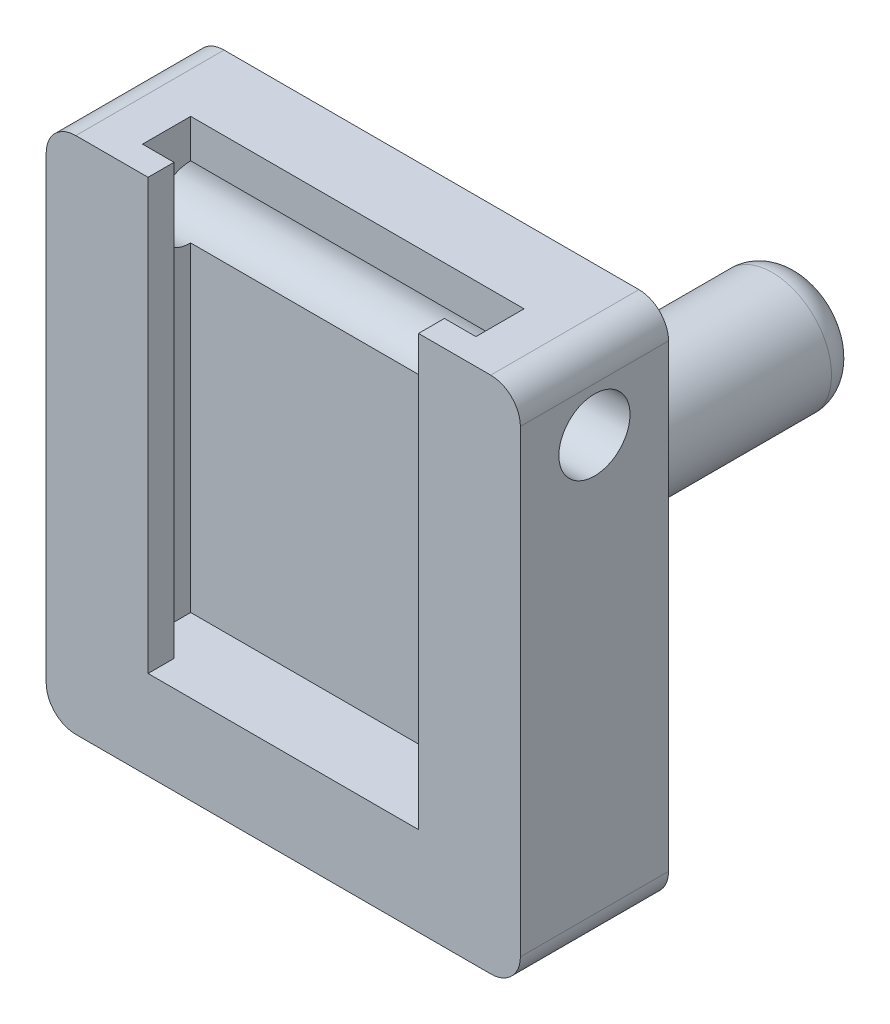
ISO-10303-21;
HEADER;
FILE_DESCRIPTION(('STEP AP214'),'2;1');
FILE_NAME('part.step','',(''),(''),'','','');
FILE_SCHEMA(('AUTOMOTIVE_DESIGN { 1 0 10303 214 1 1 1 1 }'));
ENDSEC;
DATA;
#1=APPLICATION_CONTEXT('core data for automotive mechanical design processes');
#2=APPLICATION_PROTOCOL_DEFINITION('international standard','automotive_design',2000,#1);
#3=PRODUCT_CONTEXT('',#1,'mechanical');
#4=PRODUCT('Part','Part','',(#3));
#5=PRODUCT_RELATED_PRODUCT_CATEGORY('part','',(#4));
#6=PRODUCT_DEFINITION_FORMATION('','',#4);
#7=PRODUCT_DEFINITION_CONTEXT('part definition',#1,'design');
#8=PRODUCT_DEFINITION('design','',#6,#7);
#9=PRODUCT_DEFINITION_SHAPE('','',#8);
#10=(LENGTH_UNIT() NAMED_UNIT(*) SI_UNIT(.MILLI.,.METRE.));
#11=(NAMED_UNIT(*) PLANE_ANGLE_UNIT() SI_UNIT($,.RADIAN.));
#12=(NAMED_UNIT(*) SI_UNIT($,.STERADIAN.) SOLID_ANGLE_UNIT());
#13=UNCERTAINTY_MEASURE_WITH_UNIT(LENGTH_MEASURE(1.E-05),#10,'distance_accuracy_value','');
#14=(GEOMETRIC_REPRESENTATION_CONTEXT(3) GLOBAL_UNCERTAINTY_ASSIGNED_CONTEXT((#13)) GLOBAL_UNIT_ASSIGNED_CONTEXT((#10,
#11,#12)) REPRESENTATION_CONTEXT('',''));
#15=CARTESIAN_POINT('',(0.,0.,0.));
#16=DIRECTION('',(0.,0.,1.));
#17=DIRECTION('',(1.,0.,0.));
#18=AXIS2_PLACEMENT_3D('',#15,#16,#17);
#19=CARTESIAN_POINT('',(-11.25,-36.5488611432323,5.));
#20=DIRECTION('',(0.,0.,-1.));
#21=DIRECTION('',(-1.,0.,0.));
#22=AXIS2_PLACEMENT_3D('',#19,#20,#21);
#23=PLANE('',#22);
#24=DIRECTION('',(0.,1.,0.));
#25=VECTOR('',#24,1.);
#26=CARTESIAN_POINT('',(11.25,-36.5488611432323,5.));
#27=LINE('',#26,#25);
#28=CARTESIAN_POINT('',(11.25,-7.50000000000007,5.));
#29=VERTEX_POINT('',#28);
#30=CARTESIAN_POINT('',(11.25,14.1,5.));
#31=VERTEX_POINT('',#30);
#32=EDGE_CURVE('E255',#29,#31,#27,.T.);
#33=ORIENTED_EDGE('',*,*,#32,.T.);
#34=DIRECTION('',(-1.,0.,0.));
#35=VECTOR('',#34,1.);
#36=CARTESIAN_POINT('',(-15.9999999999999,14.1,5.));
#37=LINE('',#36,#35);
#38=CARTESIAN_POINT('',(-11.25,14.1,5.));
#39=VERTEX_POINT('',#38);
#40=EDGE_CURVE('E217',#31,#39,#37,.T.);
#41=ORIENTED_EDGE('',*,*,#40,.T.);
#42=DIRECTION('',(0.,1.,0.));
#43=VECTOR('',#42,1.);
#44=CARTESIAN_POINT('',(-11.25,-36.5488611432323,5.));
#45=LINE('',#44,#43);
#46=CARTESIAN_POINT('',(-11.25,-7.50000000000007,5.));
#47=VERTEX_POINT('',#46);
#48=EDGE_CURVE('E247',#47,#39,#45,.T.);
#49=ORIENTED_EDGE('',*,*,#48,.F.);
#50=DIRECTION('',(1.,0.,0.));
#51=VECTOR('',#50,1.);
#52=CARTESIAN_POINT('',(-11.25,-7.50000000000007,5.));
#53=LINE('',#52,#51);
#54=EDGE_CURVE('E347',#47,#29,#53,.T.);
#55=ORIENTED_EDGE('',*,*,#54,.T.);
#56=EDGE_LOOP('',(#33,#41,#49,#55));
#57=FACE_BOUND('',#56,.T.);
#58=ADVANCED_FACE('F43',(#57),#23,.F.);
#59=CARTESIAN_POINT('',(-15.9999999999999,21.5,0.));
#60=DIRECTION('',(1.,0.,0.));
#61=DIRECTION('',(0.,0.,-1.));
#62=AXIS2_PLACEMENT_3D('',#59,#60,#61);
#63=PLANE('',#62);
#64=CARTESIAN_POINT('',(-15.9999999999999,16.5,5.));
#65=DIRECTION('',(-1.,0.,0.));
#66=DIRECTION('',(0.,0.,1.));
#67=AXIS2_PLACEMENT_3D('',#64,#65,#66);
#68=CIRCLE('',#67,2.4);
#69=CARTESIAN_POINT('',(-15.9999999999999,16.5,7.4));
#70=VERTEX_POINT('',#69);
#71=EDGE_CURVE('E207',#70,#70,#68,.T.);
#72=ORIENTED_EDGE('',*,*,#71,.F.);
#73=EDGE_LOOP('',(#72));
#74=FACE_BOUND('',#73,.T.);
#75=DIRECTION('',(0.,-1.,0.));
#76=VECTOR('',#75,1.);
#77=CARTESIAN_POINT('',(-15.9999999999999,21.5,0.));
#78=LINE('',#77,#76);
#79=CARTESIAN_POINT('',(-15.9999999999999,19.5,0.));
#80=VERTEX_POINT('',#79);
#81=CARTESIAN_POINT('',(-15.9999999999999,-11.5000000000001,0.));
#82=VERTEX_POINT('',#81);
#83=EDGE_CURVE('E263',#80,#82,#78,.T.);
#84=ORIENTED_EDGE('',*,*,#83,.T.);
#85=DIRECTION('',(0.,0.,-1.));
#86=VECTOR('',#85,1.);
#87=CARTESIAN_POINT('',(-15.9999999999999,-11.5000000000001,0.));
#88=LINE('',#87,#86);
#89=CARTESIAN_POINT('',(-15.9999999999999,-11.5000000000001,10.));
#90=VERTEX_POINT('',#89);
#91=EDGE_CURVE('E304',#82,#90,#88,.F.);
#92=ORIENTED_EDGE('',*,*,#91,.T.);
#93=DIRECTION('',(0.,-1.,0.));
#94=VECTOR('',#93,1.);
#95=CARTESIAN_POINT('',(-15.9999999999999,21.5,10.));
#96=LINE('',#95,#94);
#97=CARTESIAN_POINT('',(-15.9999999999999,19.5,10.));
#98=VERTEX_POINT('',#97);
#99=EDGE_CURVE('E275',#98,#90,#96,.T.);
#100=ORIENTED_EDGE('',*,*,#99,.F.);
#101=DIRECTION('',(0.,0.,1.));
#102=VECTOR('',#101,1.);
#103=CARTESIAN_POINT('',(-15.9999999999999,19.5,0.));
#104=LINE('',#103,#102);
#105=EDGE_CURVE('E303',#98,#80,#104,.F.);
#106=ORIENTED_EDGE('',*,*,#105,.T.);
#107=EDGE_LOOP('',(#84,#92,#100,#106));
#108=FACE_BOUND('',#107,.T.);
#109=ADVANCED_FACE('F383',(#74,#108),#63,.F.);
#110=CARTESIAN_POINT('',(-15.9999999999999,21.5,10.));
#111=DIRECTION('',(0.,0.,-1.));
#112=DIRECTION('',(-1.,0.,0.));
#113=AXIS2_PLACEMENT_3D('',#110,#111,#112);
#114=PLANE('',#113);
#115=ORIENTED_EDGE('',*,*,#99,.T.);
#116=CARTESIAN_POINT('',(-13.9999999999999,-11.5000000000001,10.));
#117=DIRECTION('',(0.,0.,-1.));
#118=DIRECTION('',(-1.,0.,0.));
#119=AXIS2_PLACEMENT_3D('',#116,#117,#118);
#120=CIRCLE('',#119,2.);
#121=CARTESIAN_POINT('',(-13.9999999999999,-13.5000000000001,10.));
#122=VERTEX_POINT('',#121);
#123=EDGE_CURVE('E311',#90,#122,#120,.F.);
#124=ORIENTED_EDGE('',*,*,#123,.T.);
#125=DIRECTION('',(1.,0.,0.));
#126=VECTOR('',#125,1.);
#127=CARTESIAN_POINT('',(-15.9999999999999,-13.5000000000001,10.));
#128=LINE('',#127,#126);
#129=CARTESIAN_POINT('',(14.0000000000001,-13.5000000000001,10.));
#130=VERTEX_POINT('',#129);
#131=EDGE_CURVE('E199',#122,#130,#128,.T.);
#132=ORIENTED_EDGE('',*,*,#131,.T.);
#133=CARTESIAN_POINT('',(14.0000000000001,-11.5000000000001,10.));
#134=DIRECTION('',(0.,0.,-1.));
#135=DIRECTION('',(-1.,0.,0.));
#136=AXIS2_PLACEMENT_3D('',#133,#134,#135);
#137=CIRCLE('',#136,2.);
#138=CARTESIAN_POINT('',(16.0000000000001,-11.5000000000001,10.));
#139=VERTEX_POINT('',#138);
#140=EDGE_CURVE('E307',#130,#139,#137,.F.);
#141=ORIENTED_EDGE('',*,*,#140,.T.);
#142=DIRECTION('',(0.,-1.,0.));
#143=VECTOR('',#142,1.);
#144=CARTESIAN_POINT('',(16.0000000000001,21.5,10.));
#145=LINE('',#144,#143);
#146=CARTESIAN_POINT('',(16.0000000000001,19.5,10.));
#147=VERTEX_POINT('',#146);
#148=EDGE_CURVE('E268',#147,#139,#145,.T.);
#149=ORIENTED_EDGE('',*,*,#148,.F.);
#150=CARTESIAN_POINT('',(14.0000000000001,19.5,10.));
#151=DIRECTION('',(0.,0.,-1.));
#152=DIRECTION('',(-1.,0.,0.));
#153=AXIS2_PLACEMENT_3D('',#150,#151,#152);
#154=CIRCLE('',#153,2.);
#155=CARTESIAN_POINT('',(14.0000000000001,21.5,10.));
#156=VERTEX_POINT('',#155);
#157=EDGE_CURVE('E61',#147,#156,#154,.F.);
#158=ORIENTED_EDGE('',*,*,#157,.T.);
#159=DIRECTION('',(1.,0.,0.));
#160=VECTOR('',#159,1.);
#161=CARTESIAN_POINT('',(-15.9999999999999,21.5,10.));
#162=LINE('',#161,#160);
#163=CARTESIAN_POINT('',(9.125,21.5,10.));
#164=VERTEX_POINT('',#163);
#165=EDGE_CURVE('E243',#164,#156,#162,.T.);
#166=ORIENTED_EDGE('',*,*,#165,.F.);
#167=DIRECTION('',(0.,1.,0.));
#168=VECTOR('',#167,1.);
#169=CARTESIAN_POINT('',(9.125,-36.5488611432323,10.));
#170=LINE('',#169,#168);
#171=CARTESIAN_POINT('',(9.125,-7.50000000000007,10.));
#172=VERTEX_POINT('',#171);
#173=EDGE_CURVE('E185',#172,#164,#170,.T.);
#174=ORIENTED_EDGE('',*,*,#173,.F.);
#175=DIRECTION('',(-1.,0.,0.));
#176=VECTOR('',#175,1.);
#177=CARTESIAN_POINT('',(-9.125,-7.50000000000007,10.));
#178=LINE('',#177,#176);
#179=CARTESIAN_POINT('',(-9.125,-7.50000000000007,10.));
#180=VERTEX_POINT('',#179);
#181=EDGE_CURVE('E191',#172,#180,#178,.T.);
#182=ORIENTED_EDGE('',*,*,#181,.T.);
#183=DIRECTION('',(0.,1.,0.));
#184=VECTOR('',#183,1.);
#185=CARTESIAN_POINT('',(-9.125,-36.5488611432323,10.));
#186=LINE('',#185,#184);
#187=CARTESIAN_POINT('',(-9.125,21.5,10.));
#188=VERTEX_POINT('',#187);
#189=EDGE_CURVE('E239',#180,#188,#186,.T.);
#190=ORIENTED_EDGE('',*,*,#189,.T.);
#191=CARTESIAN_POINT('',(-13.9999999999999,21.5,10.));
#192=VERTEX_POINT('',#191);
#193=EDGE_CURVE('E257',#192,#188,#162,.T.);
#194=ORIENTED_EDGE('',*,*,#193,.F.);
#195=CARTESIAN_POINT('',(-13.9999999999999,19.5,10.));
#196=DIRECTION('',(0.,0.,-1.));
#197=DIRECTION('',(-1.,0.,0.));
#198=AXIS2_PLACEMENT_3D('',#195,#196,#197);
#199=CIRCLE('',#198,2.);
#200=EDGE_CURVE('E59',#192,#98,#199,.F.);
#201=ORIENTED_EDGE('',*,*,#200,.T.);
#202=EDGE_LOOP('',(#115,#124,#132,#141,#149,#158,#166,#174,#182,#190,#194,#201));
#203=FACE_BOUND('',#202,.T.);
#204=ADVANCED_FACE('F331',(#203),#114,.F.);
#205=CARTESIAN_POINT('',(16.0000000000001,21.5,0.));
#206=DIRECTION('',(-1.,0.,0.));
#207=DIRECTION('',(0.,0.,1.));
#208=AXIS2_PLACEMENT_3D('',#205,#206,#207);
#209=PLANE('',#208);
#210=CARTESIAN_POINT('',(16.0000000000001,16.5,5.));
#211=DIRECTION('',(-1.,0.,0.));
#212=DIRECTION('',(0.,0.,1.));
#213=AXIS2_PLACEMENT_3D('',#210,#211,#212);
#214=CIRCLE('',#213,2.4);
#215=CARTESIAN_POINT('',(16.0000000000001,16.5,7.4));
#216=VERTEX_POINT('',#215);
#217=EDGE_CURVE('E208',#216,#216,#214,.T.);
#218=ORIENTED_EDGE('',*,*,#217,.T.);
#219=EDGE_LOOP('',(#218));
#220=FACE_BOUND('',#219,.T.);
#221=ORIENTED_EDGE('',*,*,#148,.T.);
#222=DIRECTION('',(0.,0.,-1.));
#223=VECTOR('',#222,1.);
#224=CARTESIAN_POINT('',(16.0000000000001,-11.5000000000001,0.));
#225=LINE('',#224,#223);
#226=CARTESIAN_POINT('',(16.0000000000001,-11.5000000000001,0.));
#227=VERTEX_POINT('',#226);
#228=EDGE_CURVE('E314',#139,#227,#225,.T.);
#229=ORIENTED_EDGE('',*,*,#228,.T.);
#230=DIRECTION('',(0.,-1.,0.));
#231=VECTOR('',#230,1.);
#232=CARTESIAN_POINT('',(16.0000000000001,21.5,0.));
#233=LINE('',#232,#231);
#234=CARTESIAN_POINT('',(16.0000000000001,19.5,0.));
#235=VERTEX_POINT('',#234);
#236=EDGE_CURVE('E269',#235,#227,#233,.T.);
#237=ORIENTED_EDGE('',*,*,#236,.F.);
#238=DIRECTION('',(0.,0.,-1.));
#239=VECTOR('',#238,1.);
#240=CARTESIAN_POINT('',(16.0000000000001,19.5,10.));
#241=LINE('',#240,#239);
#242=EDGE_CURVE('E312',#235,#147,#241,.F.);
#243=ORIENTED_EDGE('',*,*,#242,.T.);
#244=EDGE_LOOP('',(#221,#229,#237,#243));
#245=FACE_BOUND('',#244,.T.);
#246=ADVANCED_FACE('F415',(#220,#245),#209,.F.);
#247=CARTESIAN_POINT('',(-15.9999999999999,21.5,0.));
#248=DIRECTION('',(0.,0.,1.));
#249=DIRECTION('',(1.,0.,0.));
#250=AXIS2_PLACEMENT_3D('',#247,#248,#249);
#251=PLANE('',#250);
#252=CARTESIAN_POINT('',(0.,0.,0.));
#253=DIRECTION('',(0.,0.,1.));
#254=DIRECTION('',(1.,0.,0.));
#255=AXIS2_PLACEMENT_3D('',#252,#253,#254);
#256=CIRCLE('',#255,6.);
#257=CARTESIAN_POINT('',(6.,0.,0.));
#258=VERTEX_POINT('',#257);
#259=EDGE_CURVE('E292',#258,#258,#256,.T.);
#260=ORIENTED_EDGE('',*,*,#259,.T.);
#261=EDGE_LOOP('',(#260));
#262=FACE_BOUND('',#261,.T.);
#263=DIRECTION('',(1.,0.,0.));
#264=VECTOR('',#263,1.);
#265=CARTESIAN_POINT('',(-15.9999999999999,-13.5000000000001,0.));
#266=LINE('',#265,#264);
#267=CARTESIAN_POINT('',(-13.9999999999999,-13.5000000000001,0.));
#268=VERTEX_POINT('',#267);
#269=CARTESIAN_POINT('',(14.0000000000001,-13.5000000000001,0.));
#270=VERTEX_POINT('',#269);
#271=EDGE_CURVE('E197',#268,#270,#266,.T.);
#272=ORIENTED_EDGE('',*,*,#271,.F.);
#273=CARTESIAN_POINT('',(-13.9999999999999,-11.5000000000001,0.));
#274=DIRECTION('',(0.,0.,1.));
#275=DIRECTION('',(1.,0.,0.));
#276=AXIS2_PLACEMENT_3D('',#273,#274,#275);
#277=CIRCLE('',#276,2.);
#278=EDGE_CURVE('E287',#268,#82,#277,.F.);
#279=ORIENTED_EDGE('',*,*,#278,.T.);
#280=ORIENTED_EDGE('',*,*,#83,.F.);
#281=CARTESIAN_POINT('',(-13.9999999999999,19.5,0.));
#282=DIRECTION('',(0.,0.,1.));
#283=DIRECTION('',(1.,0.,0.));
#284=AXIS2_PLACEMENT_3D('',#281,#282,#283);
#285=CIRCLE('',#284,2.);
#286=CARTESIAN_POINT('',(-13.9999999999999,21.5,0.));
#287=VERTEX_POINT('',#286);
#288=EDGE_CURVE('E289',#80,#287,#285,.F.);
#289=ORIENTED_EDGE('',*,*,#288,.T.);
#290=DIRECTION('',(-1.,0.,0.));
#291=VECTOR('',#290,1.);
#292=CARTESIAN_POINT('',(-15.9999999999999,21.5,0.));
#293=LINE('',#292,#291);
#294=CARTESIAN_POINT('',(14.0000000000001,21.5,0.));
#295=VERTEX_POINT('',#294);
#296=EDGE_CURVE('E256',#295,#287,#293,.T.);
#297=ORIENTED_EDGE('',*,*,#296,.F.);
#298=CARTESIAN_POINT('',(14.0000000000001,19.5,0.));
#299=DIRECTION('',(0.,0.,1.));
#300=DIRECTION('',(1.,0.,0.));
#301=AXIS2_PLACEMENT_3D('',#298,#299,#300);
#302=CIRCLE('',#301,2.);
#303=EDGE_CURVE('E284',#295,#235,#302,.F.);
#304=ORIENTED_EDGE('',*,*,#303,.T.);
#305=ORIENTED_EDGE('',*,*,#236,.T.);
#306=CARTESIAN_POINT('',(14.0000000000001,-11.5000000000001,0.));
#307=DIRECTION('',(0.,0.,1.));
#308=DIRECTION('',(1.,0.,0.));
#309=AXIS2_PLACEMENT_3D('',#306,#307,#308);
#310=CIRCLE('',#309,2.);
#311=EDGE_CURVE('E290',#227,#270,#310,.F.);
#312=ORIENTED_EDGE('',*,*,#311,.T.);
#313=EDGE_LOOP('',(#272,#279,#280,#289,#297,#304,#305,#312));
#314=FACE_BOUND('',#313,.T.);
#315=ADVANCED_FACE('F321',(#262,#314),#251,.F.);
#316=CARTESIAN_POINT('',(0.,21.5,0.));
#317=DIRECTION('',(0.,1.,0.));
#318=DIRECTION('',(0.,0.,1.));
#319=AXIS2_PLACEMENT_3D('',#316,#317,#318);
#320=PLANE('',#319);
#321=ORIENTED_EDGE('',*,*,#296,.T.);
#322=DIRECTION('',(0.,0.,1.));
#323=VECTOR('',#322,1.);
#324=CARTESIAN_POINT('',(-13.9999999999999,21.5,10.));
#325=LINE('',#324,#323);
#326=EDGE_CURVE('E11',#287,#192,#325,.T.);
#327=ORIENTED_EDGE('',*,*,#326,.T.);
#328=ORIENTED_EDGE('',*,*,#193,.T.);
#329=DIRECTION('',(0.,0.,1.));
#330=VECTOR('',#329,1.);
#331=CARTESIAN_POINT('',(-9.125,21.5,10.));
#332=LINE('',#331,#330);
#333=CARTESIAN_POINT('',(-9.125,21.5,8.25));
#334=VERTEX_POINT('',#333);
#335=EDGE_CURVE('E240',#334,#188,#332,.T.);
#336=ORIENTED_EDGE('',*,*,#335,.F.);
#337=DIRECTION('',(1.,0.,0.));
#338=VECTOR('',#337,1.);
#339=CARTESIAN_POINT('',(-9.125,21.5,8.25));
#340=LINE('',#339,#338);
#341=CARTESIAN_POINT('',(-11.25,21.5,8.25));
#342=VERTEX_POINT('',#341);
#343=EDGE_CURVE('E234',#342,#334,#340,.T.);
#344=ORIENTED_EDGE('',*,*,#343,.F.);
#345=DIRECTION('',(0.,0.,1.));
#346=VECTOR('',#345,1.);
#347=CARTESIAN_POINT('',(-11.25,21.5,8.25));
#348=LINE('',#347,#346);
#349=CARTESIAN_POINT('',(-11.25,21.5,5.));
#350=VERTEX_POINT('',#349);
#351=EDGE_CURVE('E233',#350,#342,#348,.T.);
#352=ORIENTED_EDGE('',*,*,#351,.F.);
#353=DIRECTION('',(-1.,0.,0.));
#354=VECTOR('',#353,1.);
#355=CARTESIAN_POINT('',(-11.25,21.5,5.));
#356=LINE('',#355,#354);
#357=CARTESIAN_POINT('',(11.25,21.5,5.));
#358=VERTEX_POINT('',#357);
#359=EDGE_CURVE('E226',#358,#350,#356,.T.);
#360=ORIENTED_EDGE('',*,*,#359,.F.);
#361=DIRECTION('',(0.,0.,-1.));
#362=VECTOR('',#361,1.);
#363=CARTESIAN_POINT('',(11.25,21.5,5.));
#364=LINE('',#363,#362);
#365=CARTESIAN_POINT('',(11.25,21.5,8.25));
#366=VERTEX_POINT('',#365);
#367=EDGE_CURVE('E222',#366,#358,#364,.T.);
#368=ORIENTED_EDGE('',*,*,#367,.F.);
#369=DIRECTION('',(1.,0.,0.));
#370=VECTOR('',#369,1.);
#371=CARTESIAN_POINT('',(11.25,21.5,8.25));
#372=LINE('',#371,#370);
#373=CARTESIAN_POINT('',(9.125,21.5,8.25));
#374=VERTEX_POINT('',#373);
#375=EDGE_CURVE('E225',#374,#366,#372,.T.);
#376=ORIENTED_EDGE('',*,*,#375,.F.);
#377=DIRECTION('',(0.,0.,-1.));
#378=VECTOR('',#377,1.);
#379=CARTESIAN_POINT('',(9.125,21.5,8.25));
#380=LINE('',#379,#378);
#381=EDGE_CURVE('E180',#164,#374,#380,.T.);
#382=ORIENTED_EDGE('',*,*,#381,.F.);
#383=ORIENTED_EDGE('',*,*,#165,.T.);
#384=DIRECTION('',(0.,0.,-1.));
#385=VECTOR('',#384,1.);
#386=CARTESIAN_POINT('',(14.0000000000001,21.5,0.));
#387=LINE('',#386,#385);
#388=EDGE_CURVE('E51',#156,#295,#387,.T.);
#389=ORIENTED_EDGE('',*,*,#388,.T.);
#390=EDGE_LOOP('',(#321,#327,#328,#336,#344,#352,#360,#368,#376,#382,#383,#389));
#391=FACE_BOUND('',#390,.T.);
#392=ADVANCED_FACE('F323',(#391),#320,.T.);
#393=CARTESIAN_POINT('',(-9.125,-36.5488611432323,10.));
#394=DIRECTION('',(-1.,0.,0.));
#395=DIRECTION('',(0.,0.,1.));
#396=AXIS2_PLACEMENT_3D('',#393,#394,#395);
#397=PLANE('',#396);
#398=DIRECTION('',(0.,1.,0.));
#399=VECTOR('',#398,1.);
#400=CARTESIAN_POINT('',(-9.125,-36.5488611432323,8.25));
#401=LINE('',#400,#399);
#402=CARTESIAN_POINT('',(-9.125,-7.50000000000007,8.25));
#403=VERTEX_POINT('',#402);
#404=EDGE_CURVE('E242',#403,#334,#401,.T.);
#405=ORIENTED_EDGE('',*,*,#404,.T.);
#406=ORIENTED_EDGE('',*,*,#335,.T.);
#407=ORIENTED_EDGE('',*,*,#189,.F.);
#408=DIRECTION('',(0.,0.,-1.));
#409=VECTOR('',#408,1.);
#410=CARTESIAN_POINT('',(-9.125,-7.50000000000007,10.));
#411=LINE('',#410,#409);
#412=EDGE_CURVE('E204',#180,#403,#411,.T.);
#413=ORIENTED_EDGE('',*,*,#412,.T.);
#414=EDGE_LOOP('',(#405,#406,#407,#413));
#415=FACE_BOUND('',#414,.T.);
#416=ADVANCED_FACE('F337',(#415),#397,.F.);
#417=CARTESIAN_POINT('',(-9.125,-36.5488611432323,8.25));
#418=DIRECTION('',(0.,0.,1.));
#419=DIRECTION('',(1.,0.,0.));
#420=AXIS2_PLACEMENT_3D('',#417,#418,#419);
#421=PLANE('',#420);
#422=DIRECTION('',(0.,1.,0.));
#423=VECTOR('',#422,1.);
#424=CARTESIAN_POINT('',(-11.25,-36.5488611432323,8.25));
#425=LINE('',#424,#423);
#426=CARTESIAN_POINT('',(-11.25,-7.50000000000007,8.25));
#427=VERTEX_POINT('',#426);
#428=EDGE_CURVE('E246',#427,#342,#425,.T.);
#429=ORIENTED_EDGE('',*,*,#428,.T.);
#430=ORIENTED_EDGE('',*,*,#343,.T.);
#431=ORIENTED_EDGE('',*,*,#404,.F.);
#432=DIRECTION('',(-1.,0.,0.));
#433=VECTOR('',#432,1.);
#434=CARTESIAN_POINT('',(-9.125,-7.50000000000007,8.25));
#435=LINE('',#434,#433);
#436=EDGE_CURVE('E338',#403,#427,#435,.T.);
#437=ORIENTED_EDGE('',*,*,#436,.T.);
#438=EDGE_LOOP('',(#429,#430,#431,#437));
#439=FACE_BOUND('',#438,.T.);
#440=ADVANCED_FACE('F360',(#439),#421,.F.);
#441=CARTESIAN_POINT('',(-11.25,-36.5488611432323,8.25));
#442=DIRECTION('',(-1.,0.,0.));
#443=DIRECTION('',(0.,0.,1.));
#444=AXIS2_PLACEMENT_3D('',#441,#442,#443);
#445=PLANE('',#444);
#446=ORIENTED_EDGE('',*,*,#48,.T.);
#447=CARTESIAN_POINT('',(-11.25,16.5,5.));
#448=DIRECTION('',(-1.,0.,0.));
#449=DIRECTION('',(0.,0.,1.));
#450=AXIS2_PLACEMENT_3D('',#447,#448,#449);
#451=CIRCLE('',#450,2.4);
#452=CARTESIAN_POINT('',(-11.25,18.9,5.));
#453=VERTEX_POINT('',#452);
#454=EDGE_CURVE('E219',#39,#453,#451,.T.);
#455=ORIENTED_EDGE('',*,*,#454,.T.);
#456=EDGE_CURVE('E252',#453,#350,#45,.T.);
#457=ORIENTED_EDGE('',*,*,#456,.T.);
#458=ORIENTED_EDGE('',*,*,#351,.T.);
#459=ORIENTED_EDGE('',*,*,#428,.F.);
#460=DIRECTION('',(0.,0.,-1.));
#461=VECTOR('',#460,1.);
#462=CARTESIAN_POINT('',(-11.25,-7.50000000000007,8.25));
#463=LINE('',#462,#461);
#464=EDGE_CURVE('E343',#427,#47,#463,.T.);
#465=ORIENTED_EDGE('',*,*,#464,.T.);
#466=EDGE_LOOP('',(#446,#455,#457,#458,#459,#465));
#467=FACE_BOUND('',#466,.T.);
#468=ADVANCED_FACE('F352',(#467),#445,.F.);
#469=ORIENTED_EDGE('',*,*,#456,.F.);
#470=DIRECTION('',(-1.,0.,0.));
#471=VECTOR('',#470,1.);
#472=CARTESIAN_POINT('',(-15.9999999999999,18.9,5.));
#473=LINE('',#472,#471);
#474=CARTESIAN_POINT('',(11.25,18.9,5.));
#475=VERTEX_POINT('',#474);
#476=EDGE_CURVE('E212',#453,#475,#473,.F.);
#477=ORIENTED_EDGE('',*,*,#476,.T.);
#478=EDGE_CURVE('E253',#475,#358,#27,.T.);
#479=ORIENTED_EDGE('',*,*,#478,.T.);
#480=ORIENTED_EDGE('',*,*,#359,.T.);
#481=EDGE_LOOP('',(#469,#477,#479,#480));
#482=FACE_BOUND('',#481,.T.);
#483=ADVANCED_FACE('F364',(#482),#23,.F.);
#484=CARTESIAN_POINT('',(11.25,-36.5488611432323,5.));
#485=DIRECTION('',(1.,0.,0.));
#486=DIRECTION('',(0.,0.,-1.));
#487=AXIS2_PLACEMENT_3D('',#484,#485,#486);
#488=PLANE('',#487);
#489=ORIENTED_EDGE('',*,*,#478,.F.);
#490=CARTESIAN_POINT('',(11.25,16.5,5.));
#491=DIRECTION('',(1.,0.,0.));
#492=DIRECTION('',(0.,0.,-1.));
#493=AXIS2_PLACEMENT_3D('',#490,#491,#492);
#494=CIRCLE('',#493,2.4);
#495=EDGE_CURVE('E273',#475,#31,#494,.T.);
#496=ORIENTED_EDGE('',*,*,#495,.T.);
#497=ORIENTED_EDGE('',*,*,#32,.F.);
#498=DIRECTION('',(0.,0.,1.));
#499=VECTOR('',#498,1.);
#500=CARTESIAN_POINT('',(11.25,-7.50000000000007,5.));
#501=LINE('',#500,#499);
#502=CARTESIAN_POINT('',(11.25,-7.50000000000007,8.25));
#503=VERTEX_POINT('',#502);
#504=EDGE_CURVE('E188',#29,#503,#501,.T.);
#505=ORIENTED_EDGE('',*,*,#504,.T.);
#506=DIRECTION('',(0.,1.,0.));
#507=VECTOR('',#506,1.);
#508=CARTESIAN_POINT('',(11.25,-36.5488611432323,8.25));
#509=LINE('',#508,#507);
#510=EDGE_CURVE('E181',#503,#366,#509,.T.);
#511=ORIENTED_EDGE('',*,*,#510,.T.);
#512=ORIENTED_EDGE('',*,*,#367,.T.);
#513=EDGE_LOOP('',(#489,#496,#497,#505,#511,#512));
#514=FACE_BOUND('',#513,.T.);
#515=ADVANCED_FACE('F354',(#514),#488,.F.);
#516=CARTESIAN_POINT('',(11.25,-36.5488611432323,8.25));
#517=DIRECTION('',(0.,0.,1.));
#518=DIRECTION('',(1.,0.,0.));
#519=AXIS2_PLACEMENT_3D('',#516,#517,#518);
#520=PLANE('',#519);
#521=DIRECTION('',(0.,1.,0.));
#522=VECTOR('',#521,1.);
#523=CARTESIAN_POINT('',(9.125,-36.5488611432323,8.25));
#524=LINE('',#523,#522);
#525=CARTESIAN_POINT('',(9.125,-7.50000000000007,8.25));
#526=VERTEX_POINT('',#525);
#527=EDGE_CURVE('E167',#526,#374,#524,.T.);
#528=ORIENTED_EDGE('',*,*,#527,.T.);
#529=ORIENTED_EDGE('',*,*,#375,.T.);
#530=ORIENTED_EDGE('',*,*,#510,.F.);
#531=DIRECTION('',(-1.,0.,0.));
#532=VECTOR('',#531,1.);
#533=CARTESIAN_POINT('',(11.25,-7.50000000000007,8.25));
#534=LINE('',#533,#532);
#535=EDGE_CURVE('E184',#503,#526,#534,.T.);
#536=ORIENTED_EDGE('',*,*,#535,.T.);
#537=EDGE_LOOP('',(#528,#529,#530,#536));
#538=FACE_BOUND('',#537,.T.);
#539=ADVANCED_FACE('F187',(#538),#520,.F.);
#540=CARTESIAN_POINT('',(9.125,-36.5488611432323,8.25));
#541=DIRECTION('',(1.,0.,0.));
#542=DIRECTION('',(0.,0.,-1.));
#543=AXIS2_PLACEMENT_3D('',#540,#541,#542);
#544=PLANE('',#543);
#545=ORIENTED_EDGE('',*,*,#173,.T.);
#546=ORIENTED_EDGE('',*,*,#381,.T.);
#547=ORIENTED_EDGE('',*,*,#527,.F.);
#548=DIRECTION('',(0.,0.,1.));
#549=VECTOR('',#548,1.);
#550=CARTESIAN_POINT('',(9.125,-7.50000000000007,8.25));
#551=LINE('',#550,#549);
#552=EDGE_CURVE('E172',#526,#172,#551,.T.);
#553=ORIENTED_EDGE('',*,*,#552,.T.);
#554=EDGE_LOOP('',(#545,#546,#547,#553));
#555=FACE_BOUND('',#554,.T.);
#556=ADVANCED_FACE('F175',(#555),#544,.F.);
#557=CARTESIAN_POINT('',(-15.9999999999999,16.5,5.));
#558=DIRECTION('',(-1.,0.,0.));
#559=DIRECTION('',(0.,0.,1.));
#560=AXIS2_PLACEMENT_3D('',#557,#558,#559);
#561=CYLINDRICAL_SURFACE('',#560,2.4);
#562=ORIENTED_EDGE('',*,*,#217,.F.);
#563=EDGE_LOOP('',(#562));
#564=FACE_BOUND('',#563,.T.);
#565=ORIENTED_EDGE('',*,*,#71,.T.);
#566=EDGE_LOOP('',(#565));
#567=FACE_BOUND('',#566,.T.);
#568=ORIENTED_EDGE('',*,*,#40,.F.);
#569=ORIENTED_EDGE('',*,*,#495,.F.);
#570=ORIENTED_EDGE('',*,*,#476,.F.);
#571=ORIENTED_EDGE('',*,*,#454,.F.);
#572=EDGE_LOOP('',(#568,#569,#570,#571));
#573=FACE_BOUND('',#572,.T.);
#574=ADVANCED_FACE('F366',(#564,#567,#573),#561,.F.);
#575=CARTESIAN_POINT('',(-15.9999999999999,-13.5000000000001,10.));
#576=DIRECTION('',(0.,1.,0.));
#577=DIRECTION('',(0.,0.,1.));
#578=AXIS2_PLACEMENT_3D('',#575,#576,#577);
#579=PLANE('',#578);
#580=ORIENTED_EDGE('',*,*,#131,.F.);
#581=DIRECTION('',(0.,0.,-1.));
#582=VECTOR('',#581,1.);
#583=CARTESIAN_POINT('',(-13.9999999999999,-13.5000000000001,10.));
#584=LINE('',#583,#582);
#585=EDGE_CURVE('E297',#122,#268,#584,.T.);
#586=ORIENTED_EDGE('',*,*,#585,.T.);
#587=ORIENTED_EDGE('',*,*,#271,.T.);
#588=DIRECTION('',(0.,0.,-1.));
#589=VECTOR('',#588,1.);
#590=CARTESIAN_POINT('',(14.0000000000001,-13.5000000000001,10.));
#591=LINE('',#590,#589);
#592=EDGE_CURVE('E296',#270,#130,#591,.F.);
#593=ORIENTED_EDGE('',*,*,#592,.T.);
#594=EDGE_LOOP('',(#580,#586,#587,#593));
#595=FACE_BOUND('',#594,.T.);
#596=ADVANCED_FACE('F368',(#595),#579,.F.);
#597=CARTESIAN_POINT('',(0.,0.,-25.));
#598=DIRECTION('',(0.,0.,1.));
#599=DIRECTION('',(1.,0.,0.));
#600=AXIS2_PLACEMENT_3D('',#597,#598,#599);
#601=CYLINDRICAL_SURFACE('',#600,4.);
#602=CARTESIAN_POINT('',(0.,0.,-2.));
#603=DIRECTION('',(0.,0.,1.));
#604=DIRECTION('',(1.,0.,0.));
#605=AXIS2_PLACEMENT_3D('',#602,#603,#604);
#606=CIRCLE('',#605,4.);
#607=CARTESIAN_POINT('',(4.,0.,-2.));
#608=VERTEX_POINT('',#607);
#609=EDGE_CURVE('E282',#608,#608,#606,.F.);
#610=ORIENTED_EDGE('',*,*,#609,.T.);
#611=EDGE_LOOP('',(#610));
#612=FACE_BOUND('',#611,.T.);
#613=CARTESIAN_POINT('',(0.,0.,-23.));
#614=DIRECTION('',(0.,0.,-1.));
#615=DIRECTION('',(-1.,0.,0.));
#616=AXIS2_PLACEMENT_3D('',#613,#614,#615);
#617=CIRCLE('',#616,4.);
#618=CARTESIAN_POINT('',(-4.,0.,-23.));
#619=VERTEX_POINT('',#618);
#620=EDGE_CURVE('E277',#619,#619,#617,.F.);
#621=ORIENTED_EDGE('',*,*,#620,.T.);
#622=EDGE_LOOP('',(#621));
#623=FACE_BOUND('',#622,.T.);
#624=ADVANCED_FACE('F376',(#612,#623),#601,.T.);
#625=CARTESIAN_POINT('',(0.,0.,-25.));
#626=DIRECTION('',(0.,0.,-1.));
#627=DIRECTION('',(-1.,0.,0.));
#628=AXIS2_PLACEMENT_3D('',#625,#626,#627);
#629=PLANE('',#628);
#630=CARTESIAN_POINT('',(0.,0.,-25.));
#631=DIRECTION('',(0.,0.,-1.));
#632=DIRECTION('',(-1.,0.,0.));
#633=AXIS2_PLACEMENT_3D('',#630,#631,#632);
#634=CIRCLE('',#633,2.);
#635=CARTESIAN_POINT('',(-2.,0.,-25.));
#636=VERTEX_POINT('',#635);
#637=EDGE_CURVE('E294',#636,#636,#634,.T.);
#638=ORIENTED_EDGE('',*,*,#637,.T.);
#639=EDGE_LOOP('',(#638));
#640=FACE_BOUND('',#639,.T.);
#641=ADVANCED_FACE('F575',(#640),#629,.T.);
#642=CARTESIAN_POINT('',(-15.9999999999999,-7.50000000000007,10.));
#643=DIRECTION('',(0.,1.,0.));
#644=DIRECTION('',(0.,0.,1.));
#645=AXIS2_PLACEMENT_3D('',#642,#643,#644);
#646=PLANE('',#645);
#647=ORIENTED_EDGE('',*,*,#181,.F.);
#648=ORIENTED_EDGE('',*,*,#552,.F.);
#649=ORIENTED_EDGE('',*,*,#535,.F.);
#650=ORIENTED_EDGE('',*,*,#504,.F.);
#651=ORIENTED_EDGE('',*,*,#54,.F.);
#652=ORIENTED_EDGE('',*,*,#464,.F.);
#653=ORIENTED_EDGE('',*,*,#436,.F.);
#654=ORIENTED_EDGE('',*,*,#412,.F.);
#655=EDGE_LOOP('',(#647,#648,#649,#650,#651,#652,#653,#654));
#656=FACE_BOUND('',#655,.T.);
#657=ADVANCED_FACE('F194',(#656),#646,.T.);
#658=CARTESIAN_POINT('',(0.,0.,-2.));
#659=DIRECTION('',(0.,0.,1.));
#660=DIRECTION('',(1.,0.,0.));
#661=AXIS2_PLACEMENT_3D('',#658,#659,#660);
#662=TOROIDAL_SURFACE('',#661,6.,2.);
#663=ORIENTED_EDGE('',*,*,#259,.F.);
#664=EDGE_LOOP('',(#663));
#665=FACE_BOUND('',#664,.T.);
#666=ORIENTED_EDGE('',*,*,#609,.F.);
#667=EDGE_LOOP('',(#666));
#668=FACE_BOUND('',#667,.T.);
#669=ADVANCED_FACE('F422',(#665,#668),#662,.F.);
#670=CARTESIAN_POINT('',(0.,0.,-23.));
#671=DIRECTION('',(0.,0.,-1.));
#672=DIRECTION('',(-1.,0.,0.));
#673=AXIS2_PLACEMENT_3D('',#670,#671,#672);
#674=DEGENERATE_TOROIDAL_SURFACE('',#673,2.,2.,.T.);
#675=ORIENTED_EDGE('',*,*,#620,.F.);
#676=EDGE_LOOP('',(#675));
#677=FACE_BOUND('',#676,.T.);
#678=ORIENTED_EDGE('',*,*,#637,.F.);
#679=EDGE_LOOP('',(#678));
#680=FACE_BOUND('',#679,.T.);
#681=ADVANCED_FACE('F424',(#677,#680),#674,.T.);
#682=CARTESIAN_POINT('',(-13.9999999999999,-11.5000000000001,10.));
#683=DIRECTION('',(0.,0.,-1.));
#684=DIRECTION('',(-1.,0.,0.));
#685=AXIS2_PLACEMENT_3D('',#682,#683,#684);
#686=CYLINDRICAL_SURFACE('',#685,2.);
#687=ORIENTED_EDGE('',*,*,#123,.F.);
#688=ORIENTED_EDGE('',*,*,#91,.F.);
#689=ORIENTED_EDGE('',*,*,#278,.F.);
#690=ORIENTED_EDGE('',*,*,#585,.F.);
#691=EDGE_LOOP('',(#687,#688,#689,#690));
#692=FACE_BOUND('',#691,.T.);
#693=ADVANCED_FACE('F429',(#692),#686,.T.);
#694=CARTESIAN_POINT('',(14.0000000000001,-11.5000000000001,0.));
#695=DIRECTION('',(0.,0.,-1.));
#696=DIRECTION('',(-1.,0.,0.));
#697=AXIS2_PLACEMENT_3D('',#694,#695,#696);
#698=CYLINDRICAL_SURFACE('',#697,2.);
#699=ORIENTED_EDGE('',*,*,#140,.F.);
#700=ORIENTED_EDGE('',*,*,#592,.F.);
#701=ORIENTED_EDGE('',*,*,#311,.F.);
#702=ORIENTED_EDGE('',*,*,#228,.F.);
#703=EDGE_LOOP('',(#699,#700,#701,#702));
#704=FACE_BOUND('',#703,.T.);
#705=ADVANCED_FACE('F433',(#704),#698,.T.);
#706=CARTESIAN_POINT('',(-13.9999999999999,19.5,0.));
#707=DIRECTION('',(0.,0.,-1.));
#708=DIRECTION('',(-1.,0.,0.));
#709=AXIS2_PLACEMENT_3D('',#706,#707,#708);
#710=CYLINDRICAL_SURFACE('',#709,2.);
#711=ORIENTED_EDGE('',*,*,#288,.F.);
#712=ORIENTED_EDGE('',*,*,#105,.F.);
#713=ORIENTED_EDGE('',*,*,#200,.F.);
#714=ORIENTED_EDGE('',*,*,#326,.F.);
#715=EDGE_LOOP('',(#711,#712,#713,#714));
#716=FACE_BOUND('',#715,.T.);
#717=ADVANCED_FACE('F329',(#716),#710,.T.);
#718=CARTESIAN_POINT('',(14.0000000000001,19.5,0.));
#719=DIRECTION('',(0.,0.,1.));
#720=DIRECTION('',(1.,0.,0.));
#721=AXIS2_PLACEMENT_3D('',#718,#719,#720);
#722=CYLINDRICAL_SURFACE('',#721,2.);
#723=ORIENTED_EDGE('',*,*,#157,.F.);
#724=ORIENTED_EDGE('',*,*,#242,.F.);
#725=ORIENTED_EDGE('',*,*,#303,.F.);
#726=ORIENTED_EDGE('',*,*,#388,.F.);
#727=EDGE_LOOP('',(#723,#724,#725,#726));
#728=FACE_BOUND('',#727,.T.);
#729=ADVANCED_FACE('F44',(#728),#722,.T.);
#730=CLOSED_SHELL('',(#58,#109,#204,#246,#315,#392,#416,#440,#468,#483,#515,#539,#556,#574,#596,
#624,#641,#657,#669,#681,#693,#705,#717,#729));
#731=MANIFOLD_SOLID_BREP('B2',#730);
#732=ADVANCED_BREP_SHAPE_REPRESENTATION('',(#18,#731),#14);
#733=SHAPE_DEFINITION_REPRESENTATION(#9,#732);
ENDSEC;
END-ISO-10303-21;
